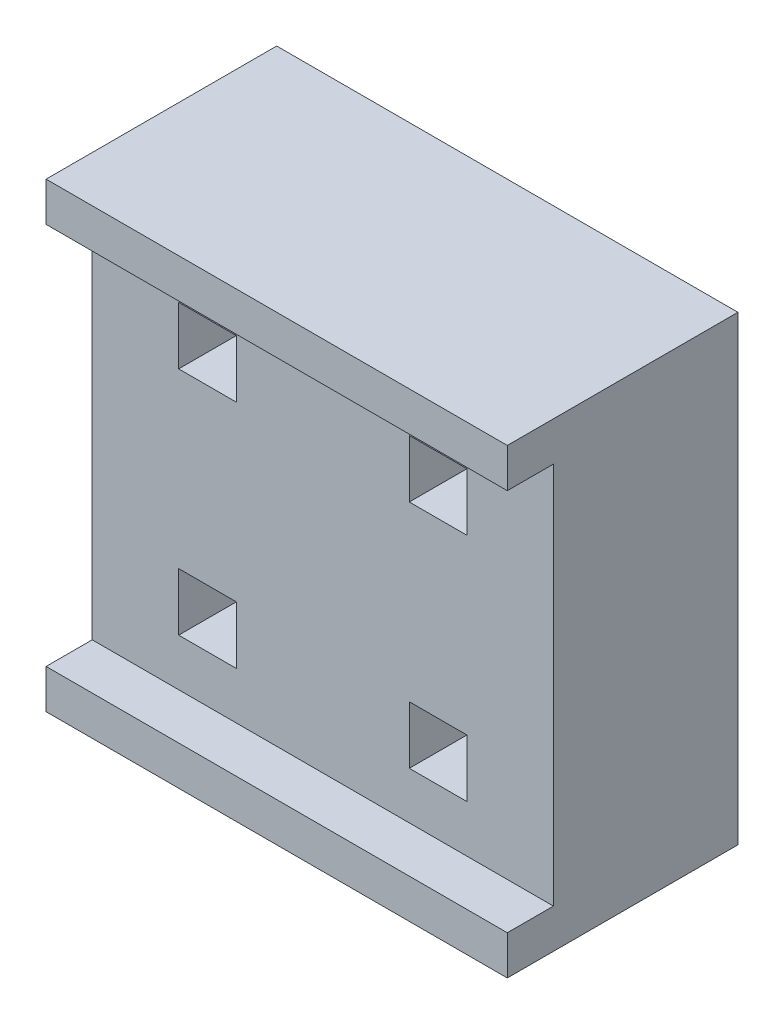
ISO-10303-21;
HEADER;
FILE_DESCRIPTION(('STEP AP214'),'2;1');
FILE_NAME('part.step','',(''),(''),'','','');
FILE_SCHEMA(('AUTOMOTIVE_DESIGN { 1 0 10303 214 1 1 1 1 }'));
ENDSEC;
DATA;
#1=APPLICATION_CONTEXT('core data for automotive mechanical design processes');
#2=APPLICATION_PROTOCOL_DEFINITION('international standard','automotive_design',2000,#1);
#3=PRODUCT_CONTEXT('',#1,'mechanical');
#4=PRODUCT('Part','Part','',(#3));
#5=PRODUCT_RELATED_PRODUCT_CATEGORY('part','',(#4));
#6=PRODUCT_DEFINITION_FORMATION('','',#4);
#7=PRODUCT_DEFINITION_CONTEXT('part definition',#1,'design');
#8=PRODUCT_DEFINITION('design','',#6,#7);
#9=PRODUCT_DEFINITION_SHAPE('','',#8);
#10=(LENGTH_UNIT() NAMED_UNIT(*) SI_UNIT(.MILLI.,.METRE.));
#11=(NAMED_UNIT(*) PLANE_ANGLE_UNIT() SI_UNIT($,.RADIAN.));
#12=(NAMED_UNIT(*) SI_UNIT($,.STERADIAN.) SOLID_ANGLE_UNIT());
#13=UNCERTAINTY_MEASURE_WITH_UNIT(LENGTH_MEASURE(1.E-05),#10,'distance_accuracy_value','');
#14=(GEOMETRIC_REPRESENTATION_CONTEXT(3) GLOBAL_UNCERTAINTY_ASSIGNED_CONTEXT((#13)) GLOBAL_UNIT_ASSIGNED_CONTEXT((#10,
#11,#12)) REPRESENTATION_CONTEXT('',''));
#15=CARTESIAN_POINT('',(0.,0.,0.));
#16=DIRECTION('',(0.,0.,1.));
#17=DIRECTION('',(1.,0.,0.));
#18=AXIS2_PLACEMENT_3D('',#15,#16,#17);
#19=CARTESIAN_POINT('',(0.000117822266474832,0.000123801387605624,6.33));
#20=DIRECTION('',(0.,-4.37113882867379E-08,1.));
#21=DIRECTION('',(0.,-1.,-4.37113882867379E-08));
#22=AXIS2_PLACEMENT_3D('',#19,#20,#21);
#23=PLANE('',#22);
#24=DIRECTION('',(1.,0.,0.));
#25=VECTOR('',#24,1.);
#26=CARTESIAN_POINT('',(-2.53988217773353,-2.10807619861239,6.32999990784765));
#27=LINE('',#26,#25);
#28=CARTESIAN_POINT('',(-2.53988217773353,-2.10807619861239,6.32999990784765));
#29=VERTEX_POINT('',#28);
#30=CARTESIAN_POINT('',(2.54011782226648,-2.10807619861239,6.32999990784765));
#31=VERTEX_POINT('',#30);
#32=EDGE_CURVE('E11',#29,#31,#27,.T.);
#33=ORIENTED_EDGE('',*,*,#32,.F.);
#34=DIRECTION('',(0.,-0.999999999999999,-4.37113882735736E-08));
#35=VECTOR('',#34,1.);
#36=CARTESIAN_POINT('',(-2.53988217773352,-2.1080761986124,6.32999990784765));
#37=LINE('',#36,#35);
#38=CARTESIAN_POINT('',(-2.53988217773353,-2.53987619861239,6.32999988897307));
#39=VERTEX_POINT('',#38);
#40=EDGE_CURVE('E368',#29,#39,#37,.T.);
#41=ORIENTED_EDGE('',*,*,#40,.T.);
#42=DIRECTION('',(1.,0.,0.));
#43=VECTOR('',#42,1.);
#44=CARTESIAN_POINT('',(-2.53988217773353,-2.53987619861239,6.32999988897307));
#45=LINE('',#44,#43);
#46=CARTESIAN_POINT('',(2.54011782226648,-2.53987619861239,6.32999988897307));
#47=VERTEX_POINT('',#46);
#48=EDGE_CURVE('E366',#39,#47,#45,.T.);
#49=ORIENTED_EDGE('',*,*,#48,.T.);
#50=DIRECTION('',(0.,0.999999999999999,4.37113882735736E-08));
#51=VECTOR('',#50,1.);
#52=CARTESIAN_POINT('',(2.54011782226648,-2.53987619861239,6.32999988897307));
#53=LINE('',#52,#51);
#54=EDGE_CURVE('E354',#47,#31,#53,.T.);
#55=ORIENTED_EDGE('',*,*,#54,.T.);
#56=EDGE_LOOP('',(#33,#41,#49,#55));
#57=FACE_BOUND('',#56,.T.);
#58=ADVANCED_FACE('F17',(#57),#23,.T.);
#59=CARTESIAN_POINT('',(-2.53988217773353,2.54012391241453,3.79000011102693));
#60=DIRECTION('',(-1.,0.,0.));
#61=DIRECTION('',(0.,-1.,-4.37113882867379E-08));
#62=AXIS2_PLACEMENT_3D('',#59,#60,#61);
#63=PLANE('',#62);
#64=DIRECTION('',(0.,4.37113897134182E-08,-0.999999999999999));
#65=VECTOR('',#64,1.);
#66=CARTESIAN_POINT('',(-2.53988217773353,-2.10807619861239,6.32999990784765));
#67=LINE('',#66,#65);
#68=CARTESIAN_POINT('',(-2.53988217773353,-2.10807617640701,5.82199990784765));
#69=VERTEX_POINT('',#68);
#70=EDGE_CURVE('E24',#29,#69,#67,.T.);
#71=ORIENTED_EDGE('',*,*,#70,.T.);
#72=DIRECTION('',(0.,0.999999999999999,4.37113881124894E-08));
#73=VECTOR('',#72,1.);
#74=CARTESIAN_POINT('',(-2.53988217773353,-2.10807617640701,5.82199990784765));
#75=LINE('',#74,#73);
#76=CARTESIAN_POINT('',(-2.53988217773353,2.10832382359299,5.82200009215235));
#77=VERTEX_POINT('',#76);
#78=EDGE_CURVE('E364',#69,#77,#75,.T.);
#79=ORIENTED_EDGE('',*,*,#78,.T.);
#80=DIRECTION('',(0.,-4.37113888392268E-08,0.999999999999999));
#81=VECTOR('',#80,1.);
#82=CARTESIAN_POINT('',(-2.53988217773353,2.10832382359299,5.82200009215235));
#83=LINE('',#82,#81);
#84=CARTESIAN_POINT('',(-2.53988217773353,2.10832380138761,6.33000009215235));
#85=VERTEX_POINT('',#84);
#86=EDGE_CURVE('E356',#77,#85,#83,.T.);
#87=ORIENTED_EDGE('',*,*,#86,.T.);
#88=DIRECTION('',(0.,-0.999999999999999,-4.37113882735736E-08));
#89=VECTOR('',#88,1.);
#90=CARTESIAN_POINT('',(-2.53988217773353,2.54012380138761,6.33000011102693));
#91=LINE('',#90,#89);
#92=CARTESIAN_POINT('',(-2.53988217773353,2.54012380138761,6.33000011102693));
#93=VERTEX_POINT('',#92);
#94=EDGE_CURVE('E347',#93,#85,#91,.T.);
#95=ORIENTED_EDGE('',*,*,#94,.F.);
#96=DIRECTION('',(0.,-4.3711388314712E-08,0.999999999999999));
#97=VECTOR('',#96,1.);
#98=CARTESIAN_POINT('',(-2.53988217773353,2.54012391241453,3.79000011102693));
#99=LINE('',#98,#97);
#100=CARTESIAN_POINT('',(-2.53988217773353,2.54012391241453,3.79000011102693));
#101=VERTEX_POINT('',#100);
#102=EDGE_CURVE('E337',#101,#93,#99,.T.);
#103=ORIENTED_EDGE('',*,*,#102,.F.);
#104=DIRECTION('',(0.,-0.999999999999999,-4.37113884895503E-08));
#105=VECTOR('',#104,1.);
#106=CARTESIAN_POINT('',(-2.53988217773353,2.54012391241453,3.79000011102693));
#107=LINE('',#106,#105);
#108=CARTESIAN_POINT('',(-2.53988217773353,-2.53987608758547,3.78999988897307));
#109=VERTEX_POINT('',#108);
#110=EDGE_CURVE('E324',#101,#109,#107,.T.);
#111=ORIENTED_EDGE('',*,*,#110,.T.);
#112=DIRECTION('',(0.,-4.3711388314712E-08,0.999999999999999));
#113=VECTOR('',#112,1.);
#114=CARTESIAN_POINT('',(-2.53988217773353,-2.53987608758547,3.78999988897307));
#115=LINE('',#114,#113);
#116=EDGE_CURVE('E358',#109,#39,#115,.T.);
#117=ORIENTED_EDGE('',*,*,#116,.T.);
#118=ORIENTED_EDGE('',*,*,#40,.F.);
#119=EDGE_LOOP('',(#71,#79,#87,#95,#103,#111,#117,#118));
#120=FACE_BOUND('',#119,.T.);
#121=ADVANCED_FACE('F374',(#120),#63,.T.);
#122=CARTESIAN_POINT('',(-2.53988217773353,-2.53987608758547,3.78999988897307));
#123=DIRECTION('',(0.,-1.,-4.37113882867379E-08));
#124=DIRECTION('',(1.,0.,0.));
#125=AXIS2_PLACEMENT_3D('',#122,#123,#124);
#126=PLANE('',#125);
#127=ORIENTED_EDGE('',*,*,#48,.F.);
#128=ORIENTED_EDGE('',*,*,#116,.F.);
#129=DIRECTION('',(1.,0.,0.));
#130=VECTOR('',#129,1.);
#131=CARTESIAN_POINT('',(-2.53988217773353,-2.53987608758547,3.78999988897307));
#132=LINE('',#131,#130);
#133=CARTESIAN_POINT('',(2.54011782226648,-2.53987608758547,3.78999988897307));
#134=VERTEX_POINT('',#133);
#135=EDGE_CURVE('E350',#109,#134,#132,.T.);
#136=ORIENTED_EDGE('',*,*,#135,.T.);
#137=DIRECTION('',(0.,-4.3711388314712E-08,0.999999999999999));
#138=VECTOR('',#137,1.);
#139=CARTESIAN_POINT('',(2.54011782226648,-2.53987608758547,3.78999988897307));
#140=LINE('',#139,#138);
#141=EDGE_CURVE('E340',#134,#47,#140,.T.);
#142=ORIENTED_EDGE('',*,*,#141,.T.);
#143=EDGE_LOOP('',(#127,#128,#136,#142));
#144=FACE_BOUND('',#143,.T.);
#145=ADVANCED_FACE('F372',(#144),#126,.T.);
#146=CARTESIAN_POINT('',(2.54011782226648,-2.53987608758547,3.78999988897307));
#147=DIRECTION('',(1.,0.,0.));
#148=DIRECTION('',(0.,1.,4.37113882867379E-08));
#149=AXIS2_PLACEMENT_3D('',#146,#147,#148);
#150=PLANE('',#149);
#151=DIRECTION('',(0.,4.37113897134182E-08,-0.999999999999999));
#152=VECTOR('',#151,1.);
#153=CARTESIAN_POINT('',(2.54011782226648,-2.10807619861239,6.32999990784765));
#154=LINE('',#153,#152);
#155=CARTESIAN_POINT('',(2.54011782226648,-2.10807617640701,5.82199990784765));
#156=VERTEX_POINT('',#155);
#157=EDGE_CURVE('E361',#31,#156,#154,.T.);
#158=ORIENTED_EDGE('',*,*,#157,.F.);
#159=ORIENTED_EDGE('',*,*,#54,.F.);
#160=ORIENTED_EDGE('',*,*,#141,.F.);
#161=DIRECTION('',(0.,0.999999999999999,4.37113881398737E-08));
#162=VECTOR('',#161,1.);
#163=CARTESIAN_POINT('',(2.54011782226648,-2.53987608758547,3.78999988897307));
#164=LINE('',#163,#162);
#165=CARTESIAN_POINT('',(2.54011782226648,2.54012391241453,3.79000011102693));
#166=VERTEX_POINT('',#165);
#167=EDGE_CURVE('E327',#134,#166,#164,.T.);
#168=ORIENTED_EDGE('',*,*,#167,.T.);
#169=DIRECTION('',(0.,-4.3711388314712E-08,0.999999999999999));
#170=VECTOR('',#169,1.);
#171=CARTESIAN_POINT('',(2.54011782226648,2.54012391241453,3.79000011102693));
#172=LINE('',#171,#170);
#173=CARTESIAN_POINT('',(2.54011782226648,2.54012380138761,6.33000011102693));
#174=VERTEX_POINT('',#173);
#175=EDGE_CURVE('E314',#166,#174,#172,.T.);
#176=ORIENTED_EDGE('',*,*,#175,.T.);
#177=DIRECTION('',(0.,0.999999999999999,4.37113882735736E-08));
#178=VECTOR('',#177,1.);
#179=CARTESIAN_POINT('',(2.54011782226647,2.10832380138761,6.33000009215235));
#180=LINE('',#179,#178);
#181=CARTESIAN_POINT('',(2.54011782226648,2.10832380138761,6.33000009215235));
#182=VERTEX_POINT('',#181);
#183=EDGE_CURVE('E304',#182,#174,#180,.T.);
#184=ORIENTED_EDGE('',*,*,#183,.F.);
#185=DIRECTION('',(0.,-4.37113888392268E-08,0.999999999999999));
#186=VECTOR('',#185,1.);
#187=CARTESIAN_POINT('',(2.54011782226648,2.10832382359299,5.82200009215235));
#188=LINE('',#187,#186);
#189=CARTESIAN_POINT('',(2.54011782226648,2.10832382359299,5.82200009215235));
#190=VERTEX_POINT('',#189);
#191=EDGE_CURVE('E290',#190,#182,#188,.T.);
#192=ORIENTED_EDGE('',*,*,#191,.F.);
#193=DIRECTION('',(0.,0.999999999999999,4.37113881124894E-08));
#194=VECTOR('',#193,1.);
#195=CARTESIAN_POINT('',(2.54011782226648,-2.10807617640701,5.82199990784765));
#196=LINE('',#195,#194);
#197=EDGE_CURVE('E279',#156,#190,#196,.T.);
#198=ORIENTED_EDGE('',*,*,#197,.F.);
#199=EDGE_LOOP('',(#158,#159,#160,#168,#176,#184,#192,#198));
#200=FACE_BOUND('',#199,.T.);
#201=ADVANCED_FACE('F382',(#200),#150,.T.);
#202=CARTESIAN_POINT('',(0.952617822266475,1.58762391241453,3.79000006939183));
#203=DIRECTION('',(-1.,0.,0.));
#204=DIRECTION('',(0.,-1.,-4.37113882867379E-08));
#205=AXIS2_PLACEMENT_3D('',#202,#203,#204);
#206=PLANE('',#205);
#207=DIRECTION('',(0.,-4.37113881835833E-08,0.999999999999999));
#208=VECTOR('',#207,1.);
#209=CARTESIAN_POINT('',(0.952617822266475,1.58762391241453,3.79000006939183));
#210=LINE('',#209,#208);
#211=CARTESIAN_POINT('',(0.952617822266475,1.58762391241453,3.79000006939183));
#212=VERTEX_POINT('',#211);
#213=CARTESIAN_POINT('',(0.952617822266475,1.58762382359299,5.82200006939183));
#214=VERTEX_POINT('',#213);
#215=EDGE_CURVE('E352',#212,#214,#210,.T.);
#216=ORIENTED_EDGE('',*,*,#215,.T.);
#217=DIRECTION('',(0.,-0.999999999999999,-4.37113890140651E-08));
#218=VECTOR('',#217,1.);
#219=CARTESIAN_POINT('',(0.952617822266475,1.58762382359299,5.82200006939183));
#220=LINE('',#219,#218);
#221=CARTESIAN_POINT('',(0.952617822266475,0.952623823592991,5.8220000416351));
#222=VERTEX_POINT('',#221);
#223=EDGE_CURVE('E343',#214,#222,#220,.T.);
#224=ORIENTED_EDGE('',*,*,#223,.T.);
#225=DIRECTION('',(0.,-4.37113882928572E-08,0.999999999999999));
#226=VECTOR('',#225,1.);
#227=CARTESIAN_POINT('',(0.952617822266475,0.952623912414532,3.7900000416351));
#228=LINE('',#227,#226);
#229=CARTESIAN_POINT('',(0.952617822266475,0.952623912414532,3.7900000416351));
#230=VERTEX_POINT('',#229);
#231=EDGE_CURVE('E329',#230,#222,#228,.T.);
#232=ORIENTED_EDGE('',*,*,#231,.F.);
#233=DIRECTION('',(0.,-0.999999999999999,-4.3711388314712E-08));
#234=VECTOR('',#233,1.);
#235=CARTESIAN_POINT('',(0.952617822266475,1.58762391241453,3.79000006939183));
#236=LINE('',#235,#234);
#237=EDGE_CURVE('E316',#212,#230,#236,.T.);
#238=ORIENTED_EDGE('',*,*,#237,.F.);
#239=EDGE_LOOP('',(#216,#224,#232,#238));
#240=FACE_BOUND('',#239,.T.);
#241=ADVANCED_FACE('F426',(#240),#206,.F.);
#242=CARTESIAN_POINT('',(1.58761782226647,1.58762391241453,3.79000006939183));
#243=DIRECTION('',(0.,1.,4.37113882867379E-08));
#244=DIRECTION('',(-1.,0.,0.));
#245=AXIS2_PLACEMENT_3D('',#242,#243,#244);
#246=PLANE('',#245);
#247=DIRECTION('',(0.,-4.37113881835833E-08,0.999999999999999));
#248=VECTOR('',#247,1.);
#249=CARTESIAN_POINT('',(1.58761782226647,1.58762391241453,3.79000006939183));
#250=LINE('',#249,#248);
#251=CARTESIAN_POINT('',(1.58761782226647,1.58762391241453,3.79000006939183));
#252=VERTEX_POINT('',#251);
#253=CARTESIAN_POINT('',(1.58761782226647,1.58762382359299,5.82200006939183));
#254=VERTEX_POINT('',#253);
#255=EDGE_CURVE('E345',#252,#254,#250,.T.);
#256=ORIENTED_EDGE('',*,*,#255,.T.);
#257=DIRECTION('',(-1.,0.,0.));
#258=VECTOR('',#257,1.);
#259=CARTESIAN_POINT('',(1.58761782226647,1.58762382359299,5.82200006939183));
#260=LINE('',#259,#258);
#261=EDGE_CURVE('E332',#254,#214,#260,.T.);
#262=ORIENTED_EDGE('',*,*,#261,.T.);
#263=ORIENTED_EDGE('',*,*,#215,.F.);
#264=DIRECTION('',(-1.,0.,0.));
#265=VECTOR('',#264,1.);
#266=CARTESIAN_POINT('',(1.58761782226647,1.58762391241453,3.79000006939183));
#267=LINE('',#266,#265);
#268=EDGE_CURVE('E307',#252,#212,#267,.T.);
#269=ORIENTED_EDGE('',*,*,#268,.F.);
#270=EDGE_LOOP('',(#256,#262,#263,#269));
#271=FACE_BOUND('',#270,.T.);
#272=ADVANCED_FACE('F431',(#271),#246,.F.);
#273=CARTESIAN_POINT('',(1.58761782226647,0.952623912414532,3.7900000416351));
#274=DIRECTION('',(1.,0.,0.));
#275=DIRECTION('',(0.,1.,4.37113882867379E-08));
#276=AXIS2_PLACEMENT_3D('',#273,#274,#275);
#277=PLANE('',#276);
#278=DIRECTION('',(0.,-4.37113882928572E-08,0.999999999999999));
#279=VECTOR('',#278,1.);
#280=CARTESIAN_POINT('',(1.58761782226647,0.952623912414532,3.7900000416351));
#281=LINE('',#280,#279);
#282=CARTESIAN_POINT('',(1.58761782226647,0.952623912414532,3.7900000416351));
#283=VERTEX_POINT('',#282);
#284=CARTESIAN_POINT('',(1.58761782226647,0.952623823592991,5.8220000416351));
#285=VERTEX_POINT('',#284);
#286=EDGE_CURVE('E335',#283,#285,#281,.T.);
#287=ORIENTED_EDGE('',*,*,#286,.T.);
#288=DIRECTION('',(0.,0.999999999999999,4.37113890140651E-08));
#289=VECTOR('',#288,1.);
#290=CARTESIAN_POINT('',(1.58761782226647,0.952623823592991,5.8220000416351));
#291=LINE('',#290,#289);
#292=EDGE_CURVE('E319',#285,#254,#291,.T.);
#293=ORIENTED_EDGE('',*,*,#292,.T.);
#294=ORIENTED_EDGE('',*,*,#255,.F.);
#295=DIRECTION('',(0.,0.999999999999999,4.3711388314712E-08));
#296=VECTOR('',#295,1.);
#297=CARTESIAN_POINT('',(1.58761782226647,0.952623912414532,3.7900000416351));
#298=LINE('',#297,#296);
#299=EDGE_CURVE('E293',#283,#252,#298,.T.);
#300=ORIENTED_EDGE('',*,*,#299,.F.);
#301=EDGE_LOOP('',(#287,#293,#294,#300));
#302=FACE_BOUND('',#301,.T.);
#303=ADVANCED_FACE('F436',(#302),#277,.F.);
#304=CARTESIAN_POINT('',(0.952617822266475,-0.952376087585468,3.7899999583649));
#305=DIRECTION('',(-1.,0.,0.));
#306=DIRECTION('',(0.,-1.,-4.37113882867379E-08));
#307=AXIS2_PLACEMENT_3D('',#304,#305,#306);
#308=PLANE('',#307);
#309=DIRECTION('',(0.,-4.37113882928572E-08,0.999999999999999));
#310=VECTOR('',#309,1.);
#311=CARTESIAN_POINT('',(0.952617822266475,-0.952376087585468,3.7899999583649));
#312=LINE('',#311,#310);
#313=CARTESIAN_POINT('',(0.952617822266475,-0.952376087585468,3.7899999583649));
#314=VERTEX_POINT('',#313);
#315=CARTESIAN_POINT('',(0.952617822266475,-0.952376176407009,5.8219999583649));
#316=VERTEX_POINT('',#315);
#317=EDGE_CURVE('E322',#314,#316,#312,.T.);
#318=ORIENTED_EDGE('',*,*,#317,.T.);
#319=DIRECTION('',(0.,-0.999999999999999,-4.37113890140651E-08));
#320=VECTOR('',#319,1.);
#321=CARTESIAN_POINT('',(0.952617822266475,-0.952376176407009,5.8219999583649));
#322=LINE('',#321,#320);
#323=CARTESIAN_POINT('',(0.952617822266475,-1.58737617640701,5.82199993060817));
#324=VERTEX_POINT('',#323);
#325=EDGE_CURVE('E310',#316,#324,#322,.T.);
#326=ORIENTED_EDGE('',*,*,#325,.T.);
#327=DIRECTION('',(0.,-4.37113884021311E-08,0.999999999999999));
#328=VECTOR('',#327,1.);
#329=CARTESIAN_POINT('',(0.952617822266475,-1.58737608758547,3.78999993060817));
#330=LINE('',#329,#328);
#331=CARTESIAN_POINT('',(0.952617822266475,-1.58737608758547,3.78999993060817));
#332=VERTEX_POINT('',#331);
#333=EDGE_CURVE('E296',#332,#324,#330,.T.);
#334=ORIENTED_EDGE('',*,*,#333,.F.);
#335=DIRECTION('',(0.,-0.999999999999999,-4.3711388314712E-08));
#336=VECTOR('',#335,1.);
#337=CARTESIAN_POINT('',(0.952617822266475,-0.952376087585468,3.7899999583649));
#338=LINE('',#337,#336);
#339=EDGE_CURVE('E282',#314,#332,#338,.T.);
#340=ORIENTED_EDGE('',*,*,#339,.F.);
#341=EDGE_LOOP('',(#318,#326,#334,#340));
#342=FACE_BOUND('',#341,.T.);
#343=ADVANCED_FACE('F441',(#342),#308,.F.);
#344=CARTESIAN_POINT('',(1.58761782226647,-0.952376087585468,3.7899999583649));
#345=DIRECTION('',(0.,1.,4.37113882867379E-08));
#346=DIRECTION('',(-1.,0.,0.));
#347=AXIS2_PLACEMENT_3D('',#344,#345,#346);
#348=PLANE('',#347);
#349=DIRECTION('',(0.,-4.37113882928572E-08,0.999999999999999));
#350=VECTOR('',#349,1.);
#351=CARTESIAN_POINT('',(1.58761782226647,-0.952376087585468,3.7899999583649));
#352=LINE('',#351,#350);
#353=CARTESIAN_POINT('',(1.58761782226647,-0.952376087585468,3.7899999583649));
#354=VERTEX_POINT('',#353);
#355=CARTESIAN_POINT('',(1.58761782226647,-0.952376176407009,5.8219999583649));
#356=VERTEX_POINT('',#355);
#357=EDGE_CURVE('E312',#354,#356,#352,.T.);
#358=ORIENTED_EDGE('',*,*,#357,.T.);
#359=DIRECTION('',(-1.,0.,0.));
#360=VECTOR('',#359,1.);
#361=CARTESIAN_POINT('',(1.58761782226647,-0.952376176407009,5.8219999583649));
#362=LINE('',#361,#360);
#363=EDGE_CURVE('E299',#356,#316,#362,.T.);
#364=ORIENTED_EDGE('',*,*,#363,.T.);
#365=ORIENTED_EDGE('',*,*,#317,.F.);
#366=DIRECTION('',(-1.,0.,0.));
#367=VECTOR('',#366,1.);
#368=CARTESIAN_POINT('',(1.58761782226647,-0.952376087585468,3.7899999583649));
#369=LINE('',#368,#367);
#370=EDGE_CURVE('E272',#354,#314,#369,.T.);
#371=ORIENTED_EDGE('',*,*,#370,.F.);
#372=EDGE_LOOP('',(#358,#364,#365,#371));
#373=FACE_BOUND('',#372,.T.);
#374=ADVANCED_FACE('F446',(#373),#348,.F.);
#375=CARTESIAN_POINT('',(1.58761782226647,-1.58737608758547,3.78999993060817));
#376=DIRECTION('',(1.,0.,0.));
#377=DIRECTION('',(0.,1.,4.37113882867379E-08));
#378=AXIS2_PLACEMENT_3D('',#375,#376,#377);
#379=PLANE('',#378);
#380=DIRECTION('',(0.,-4.37113884021311E-08,0.999999999999999));
#381=VECTOR('',#380,1.);
#382=CARTESIAN_POINT('',(1.58761782226647,-1.58737608758547,3.78999993060817));
#383=LINE('',#382,#381);
#384=CARTESIAN_POINT('',(1.58761782226647,-1.58737608758547,3.78999993060817));
#385=VERTEX_POINT('',#384);
#386=CARTESIAN_POINT('',(1.58761782226647,-1.58737617640701,5.82199993060817));
#387=VERTEX_POINT('',#386);
#388=EDGE_CURVE('E302',#385,#387,#383,.T.);
#389=ORIENTED_EDGE('',*,*,#388,.T.);
#390=DIRECTION('',(0.,0.999999999999999,4.37113890140651E-08));
#391=VECTOR('',#390,1.);
#392=CARTESIAN_POINT('',(1.58761782226647,-1.58737617640701,5.82199993060817));
#393=LINE('',#392,#391);
#394=EDGE_CURVE('E285',#387,#356,#393,.T.);
#395=ORIENTED_EDGE('',*,*,#394,.T.);
#396=ORIENTED_EDGE('',*,*,#357,.F.);
#397=DIRECTION('',(0.,0.999999999999999,4.3711388314712E-08));
#398=VECTOR('',#397,1.);
#399=CARTESIAN_POINT('',(1.58761782226647,-1.58737608758547,3.78999993060817));
#400=LINE('',#399,#398);
#401=EDGE_CURVE('E261',#385,#354,#400,.T.);
#402=ORIENTED_EDGE('',*,*,#401,.F.);
#403=EDGE_LOOP('',(#389,#395,#396,#402));
#404=FACE_BOUND('',#403,.T.);
#405=ADVANCED_FACE('F474',(#404),#379,.F.);
#406=CARTESIAN_POINT('',(-1.58738217773353,1.58762391241453,3.79000006939183));
#407=DIRECTION('',(-1.,0.,0.));
#408=DIRECTION('',(0.,-1.,-4.37113882867379E-08));
#409=AXIS2_PLACEMENT_3D('',#406,#407,#408);
#410=PLANE('',#409);
#411=DIRECTION('',(0.,-4.37113881835833E-08,0.999999999999999));
#412=VECTOR('',#411,1.);
#413=CARTESIAN_POINT('',(-1.58738217773353,1.58762391241453,3.79000006939183));
#414=LINE('',#413,#412);
#415=CARTESIAN_POINT('',(-1.58738217773353,1.58762391241453,3.79000006939183));
#416=VERTEX_POINT('',#415);
#417=CARTESIAN_POINT('',(-1.58738217773353,1.58762382359299,5.82200006939183));
#418=VERTEX_POINT('',#417);
#419=EDGE_CURVE('E288',#416,#418,#414,.T.);
#420=ORIENTED_EDGE('',*,*,#419,.T.);
#421=DIRECTION('',(0.,-0.999999999999999,-4.37113890140651E-08));
#422=VECTOR('',#421,1.);
#423=CARTESIAN_POINT('',(-1.58738217773353,1.58762382359299,5.82200006939183));
#424=LINE('',#423,#422);
#425=CARTESIAN_POINT('',(-1.58738217773353,0.952623823592991,5.8220000416351));
#426=VERTEX_POINT('',#425);
#427=EDGE_CURVE('E275',#418,#426,#424,.T.);
#428=ORIENTED_EDGE('',*,*,#427,.T.);
#429=DIRECTION('',(0.,-4.37113882928572E-08,0.999999999999999));
#430=VECTOR('',#429,1.);
#431=CARTESIAN_POINT('',(-1.58738217773353,0.952623912414532,3.7900000416351));
#432=LINE('',#431,#430);
#433=CARTESIAN_POINT('',(-1.58738217773353,0.952623912414532,3.7900000416351));
#434=VERTEX_POINT('',#433);
#435=EDGE_CURVE('E264',#434,#426,#432,.T.);
#436=ORIENTED_EDGE('',*,*,#435,.F.);
#437=DIRECTION('',(0.,-0.999999999999999,-4.3711388314712E-08));
#438=VECTOR('',#437,1.);
#439=CARTESIAN_POINT('',(-1.58738217773353,1.58762391241453,3.79000006939183));
#440=LINE('',#439,#438);
#441=EDGE_CURVE('E253',#416,#434,#440,.T.);
#442=ORIENTED_EDGE('',*,*,#441,.F.);
#443=EDGE_LOOP('',(#420,#428,#436,#442));
#444=FACE_BOUND('',#443,.T.);
#445=ADVANCED_FACE('F478',(#444),#410,.F.);
#446=CARTESIAN_POINT('',(-0.952382177733525,1.58762391241453,3.79000006939183));
#447=DIRECTION('',(0.,1.,4.37113882867379E-08));
#448=DIRECTION('',(-1.,0.,0.));
#449=AXIS2_PLACEMENT_3D('',#446,#447,#448);
#450=PLANE('',#449);
#451=DIRECTION('',(0.,-4.37113881835833E-08,0.999999999999999));
#452=VECTOR('',#451,1.);
#453=CARTESIAN_POINT('',(-0.952382177733525,1.58762391241453,3.79000006939183));
#454=LINE('',#453,#452);
#455=CARTESIAN_POINT('',(-0.952382177733525,1.58762391241453,3.79000006939183));
#456=VERTEX_POINT('',#455);
#457=CARTESIAN_POINT('',(-0.952382177733525,1.58762382359299,5.82200006939183));
#458=VERTEX_POINT('',#457);
#459=EDGE_CURVE('E277',#456,#458,#454,.T.);
#460=ORIENTED_EDGE('',*,*,#459,.T.);
#461=DIRECTION('',(-1.,0.,0.));
#462=VECTOR('',#461,1.);
#463=CARTESIAN_POINT('',(-0.952382177733525,1.58762382359299,5.82200006939183));
#464=LINE('',#463,#462);
#465=EDGE_CURVE('E267',#458,#418,#464,.T.);
#466=ORIENTED_EDGE('',*,*,#465,.T.);
#467=ORIENTED_EDGE('',*,*,#419,.F.);
#468=DIRECTION('',(-1.,0.,0.));
#469=VECTOR('',#468,1.);
#470=CARTESIAN_POINT('',(-0.952382177733525,1.58762391241453,3.79000006939183));
#471=LINE('',#470,#469);
#472=EDGE_CURVE('E197',#456,#416,#471,.T.);
#473=ORIENTED_EDGE('',*,*,#472,.F.);
#474=EDGE_LOOP('',(#460,#466,#467,#473));
#475=FACE_BOUND('',#474,.T.);
#476=ADVANCED_FACE('F481',(#475),#450,.F.);
#477=CARTESIAN_POINT('',(-0.952382177733525,0.952623912414532,3.7900000416351));
#478=DIRECTION('',(1.,0.,0.));
#479=DIRECTION('',(0.,1.,4.37113882867379E-08));
#480=AXIS2_PLACEMENT_3D('',#477,#478,#479);
#481=PLANE('',#480);
#482=DIRECTION('',(0.,-4.37113882928572E-08,0.999999999999999));
#483=VECTOR('',#482,1.);
#484=CARTESIAN_POINT('',(-0.952382177733525,0.952623912414532,3.7900000416351));
#485=LINE('',#484,#483);
#486=CARTESIAN_POINT('',(-0.952382177733525,0.952623912414532,3.7900000416351));
#487=VERTEX_POINT('',#486);
#488=CARTESIAN_POINT('',(-0.952382177733525,0.952623823592991,5.8220000416351));
#489=VERTEX_POINT('',#488);
#490=EDGE_CURVE('E270',#487,#489,#485,.T.);
#491=ORIENTED_EDGE('',*,*,#490,.T.);
#492=DIRECTION('',(0.,0.999999999999999,4.37113890140651E-08));
#493=VECTOR('',#492,1.);
#494=CARTESIAN_POINT('',(-0.952382177733525,0.952623823592991,5.8220000416351));
#495=LINE('',#494,#493);
#496=EDGE_CURVE('E256',#489,#458,#495,.T.);
#497=ORIENTED_EDGE('',*,*,#496,.T.);
#498=ORIENTED_EDGE('',*,*,#459,.F.);
#499=DIRECTION('',(0.,0.999999999999999,4.3711388314712E-08));
#500=VECTOR('',#499,1.);
#501=CARTESIAN_POINT('',(-0.952382177733525,0.952623912414532,3.7900000416351));
#502=LINE('',#501,#500);
#503=EDGE_CURVE('E241',#487,#456,#502,.T.);
#504=ORIENTED_EDGE('',*,*,#503,.F.);
#505=EDGE_LOOP('',(#491,#497,#498,#504));
#506=FACE_BOUND('',#505,.T.);
#507=ADVANCED_FACE('F486',(#506),#481,.F.);
#508=CARTESIAN_POINT('',(-1.58738217773353,-0.952376087585468,3.7899999583649));
#509=DIRECTION('',(-1.,0.,0.));
#510=DIRECTION('',(0.,-1.,-4.37113882867379E-08));
#511=AXIS2_PLACEMENT_3D('',#508,#509,#510);
#512=PLANE('',#511);
#513=DIRECTION('',(0.,-4.37113882928572E-08,0.999999999999999));
#514=VECTOR('',#513,1.);
#515=CARTESIAN_POINT('',(-1.58738217773353,-0.952376087585468,3.7899999583649));
#516=LINE('',#515,#514);
#517=CARTESIAN_POINT('',(-1.58738217773353,-0.952376087585468,3.7899999583649));
#518=VERTEX_POINT('',#517);
#519=CARTESIAN_POINT('',(-1.58738217773353,-0.952376176407009,5.8219999583649));
#520=VERTEX_POINT('',#519);
#521=EDGE_CURVE('E259',#518,#520,#516,.T.);
#522=ORIENTED_EDGE('',*,*,#521,.T.);
#523=DIRECTION('',(0.,-0.999999999999999,-4.37113890140651E-08));
#524=VECTOR('',#523,1.);
#525=CARTESIAN_POINT('',(-1.58738217773353,-0.952376176407009,5.8219999583649));
#526=LINE('',#525,#524);
#527=CARTESIAN_POINT('',(-1.58738217773353,-1.58737617640701,5.82199993060817));
#528=VERTEX_POINT('',#527);
#529=EDGE_CURVE('E250',#520,#528,#526,.T.);
#530=ORIENTED_EDGE('',*,*,#529,.T.);
#531=DIRECTION('',(0.,-4.37113884021311E-08,0.999999999999999));
#532=VECTOR('',#531,1.);
#533=CARTESIAN_POINT('',(-1.58738217773353,-1.58737608758547,3.78999993060817));
#534=LINE('',#533,#532);
#535=CARTESIAN_POINT('',(-1.58738217773353,-1.58737608758547,3.78999993060817));
#536=VERTEX_POINT('',#535);
#537=EDGE_CURVE('E244',#536,#528,#534,.T.);
#538=ORIENTED_EDGE('',*,*,#537,.F.);
#539=DIRECTION('',(0.,-0.999999999999999,-4.3711388314712E-08));
#540=VECTOR('',#539,1.);
#541=CARTESIAN_POINT('',(-1.58738217773353,-0.952376087585468,3.7899999583649));
#542=LINE('',#541,#540);
#543=EDGE_CURVE('E202',#518,#536,#542,.T.);
#544=ORIENTED_EDGE('',*,*,#543,.F.);
#545=EDGE_LOOP('',(#522,#530,#538,#544));
#546=FACE_BOUND('',#545,.T.);
#547=ADVANCED_FACE('F490',(#546),#512,.F.);
#548=CARTESIAN_POINT('',(-0.952382177733525,-0.952376087585468,3.7899999583649));
#549=DIRECTION('',(0.,1.,4.37113882867379E-08));
#550=DIRECTION('',(-1.,0.,0.));
#551=AXIS2_PLACEMENT_3D('',#548,#549,#550);
#552=PLANE('',#551);
#553=DIRECTION('',(0.,-4.37113882928572E-08,0.999999999999999));
#554=VECTOR('',#553,1.);
#555=CARTESIAN_POINT('',(-0.952382177733525,-0.952376087585468,3.7899999583649));
#556=LINE('',#555,#554);
#557=CARTESIAN_POINT('',(-0.952382177733525,-0.952376087585468,3.7899999583649));
#558=VERTEX_POINT('',#557);
#559=CARTESIAN_POINT('',(-0.952382177733525,-0.952376176407009,5.8219999583649));
#560=VERTEX_POINT('',#559);
#561=EDGE_CURVE('E180',#558,#560,#556,.T.);
#562=ORIENTED_EDGE('',*,*,#561,.T.);
#563=DIRECTION('',(-1.,0.,0.));
#564=VECTOR('',#563,1.);
#565=CARTESIAN_POINT('',(-0.952382177733525,-0.952376176407009,5.8219999583649));
#566=LINE('',#565,#564);
#567=EDGE_CURVE('E198',#560,#520,#566,.T.);
#568=ORIENTED_EDGE('',*,*,#567,.T.);
#569=ORIENTED_EDGE('',*,*,#521,.F.);
#570=DIRECTION('',(-1.,0.,0.));
#571=VECTOR('',#570,1.);
#572=CARTESIAN_POINT('',(-0.952382177733525,-0.952376087585468,3.7899999583649));
#573=LINE('',#572,#571);
#574=EDGE_CURVE('E233',#558,#518,#573,.T.);
#575=ORIENTED_EDGE('',*,*,#574,.F.);
#576=EDGE_LOOP('',(#562,#568,#569,#575));
#577=FACE_BOUND('',#576,.T.);
#578=ADVANCED_FACE('F469',(#577),#552,.F.);
#579=CARTESIAN_POINT('',(-0.952382177733525,-1.58737608758547,3.78999993060817));
#580=DIRECTION('',(1.,0.,0.));
#581=DIRECTION('',(0.,1.,4.37113882867379E-08));
#582=AXIS2_PLACEMENT_3D('',#579,#580,#581);
#583=PLANE('',#582);
#584=DIRECTION('',(0.,-4.37113884021311E-08,0.999999999999999));
#585=VECTOR('',#584,1.);
#586=CARTESIAN_POINT('',(-0.952382177733525,-1.58737608758547,3.78999993060817));
#587=LINE('',#586,#585);
#588=CARTESIAN_POINT('',(-0.952382177733525,-1.58737608758547,3.78999993060817));
#589=VERTEX_POINT('',#588);
#590=CARTESIAN_POINT('',(-0.952382177733525,-1.58737617640701,5.82199993060817));
#591=VERTEX_POINT('',#590);
#592=EDGE_CURVE('E178',#589,#591,#587,.T.);
#593=ORIENTED_EDGE('',*,*,#592,.T.);
#594=DIRECTION('',(0.,0.999999999999999,4.37113890140651E-08));
#595=VECTOR('',#594,1.);
#596=CARTESIAN_POINT('',(-0.952382177733525,-1.58737617640701,5.82199993060817));
#597=LINE('',#596,#595);
#598=EDGE_CURVE('E239',#591,#560,#597,.T.);
#599=ORIENTED_EDGE('',*,*,#598,.T.);
#600=ORIENTED_EDGE('',*,*,#561,.F.);
#601=DIRECTION('',(0.,0.999999999999999,4.3711388314712E-08));
#602=VECTOR('',#601,1.);
#603=CARTESIAN_POINT('',(-0.952382177733525,-1.58737608758547,3.78999993060817));
#604=LINE('',#603,#602);
#605=EDGE_CURVE('E174',#589,#558,#604,.T.);
#606=ORIENTED_EDGE('',*,*,#605,.F.);
#607=EDGE_LOOP('',(#593,#599,#600,#606));
#608=FACE_BOUND('',#607,.T.);
#609=ADVANCED_FACE('F176',(#608),#583,.F.);
#610=CARTESIAN_POINT('',(0.952617822266475,0.952623912414532,3.7900000416351));
#611=DIRECTION('',(0.,-1.,-4.37113882867379E-08));
#612=DIRECTION('',(1.,0.,0.));
#613=AXIS2_PLACEMENT_3D('',#610,#611,#612);
#614=PLANE('',#613);
#615=ORIENTED_EDGE('',*,*,#231,.T.);
#616=DIRECTION('',(1.,0.,0.));
#617=VECTOR('',#616,1.);
#618=CARTESIAN_POINT('',(0.952617822266475,0.952623823592991,5.8220000416351));
#619=LINE('',#618,#617);
#620=EDGE_CURVE('E235',#222,#285,#619,.T.);
#621=ORIENTED_EDGE('',*,*,#620,.T.);
#622=ORIENTED_EDGE('',*,*,#286,.F.);
#623=DIRECTION('',(1.,0.,0.));
#624=VECTOR('',#623,1.);
#625=CARTESIAN_POINT('',(0.952617822266475,0.952623912414532,3.7900000416351));
#626=LINE('',#625,#624);
#627=EDGE_CURVE('E226',#230,#283,#626,.T.);
#628=ORIENTED_EDGE('',*,*,#627,.F.);
#629=EDGE_LOOP('',(#615,#621,#622,#628));
#630=FACE_BOUND('',#629,.T.);
#631=ADVANCED_FACE('F454',(#630),#614,.F.);
#632=CARTESIAN_POINT('',(0.952617822266475,-1.58737608758547,3.78999993060817));
#633=DIRECTION('',(0.,-1.,-4.37113882867379E-08));
#634=DIRECTION('',(1.,0.,0.));
#635=AXIS2_PLACEMENT_3D('',#632,#633,#634);
#636=PLANE('',#635);
#637=ORIENTED_EDGE('',*,*,#333,.T.);
#638=DIRECTION('',(1.,0.,0.));
#639=VECTOR('',#638,1.);
#640=CARTESIAN_POINT('',(0.952617822266475,-1.58737617640701,5.82199993060817));
#641=LINE('',#640,#639);
#642=EDGE_CURVE('E185',#324,#387,#641,.T.);
#643=ORIENTED_EDGE('',*,*,#642,.T.);
#644=ORIENTED_EDGE('',*,*,#388,.F.);
#645=DIRECTION('',(1.,0.,0.));
#646=VECTOR('',#645,1.);
#647=CARTESIAN_POINT('',(0.952617822266475,-1.58737608758547,3.78999993060817));
#648=LINE('',#647,#646);
#649=EDGE_CURVE('E219',#332,#385,#648,.T.);
#650=ORIENTED_EDGE('',*,*,#649,.F.);
#651=EDGE_LOOP('',(#637,#643,#644,#650));
#652=FACE_BOUND('',#651,.T.);
#653=ADVANCED_FACE('F461',(#652),#636,.F.);
#654=CARTESIAN_POINT('',(-1.58738217773353,0.952623912414532,3.7900000416351));
#655=DIRECTION('',(0.,-1.,-4.37113882867379E-08));
#656=DIRECTION('',(1.,0.,0.));
#657=AXIS2_PLACEMENT_3D('',#654,#655,#656);
#658=PLANE('',#657);
#659=ORIENTED_EDGE('',*,*,#435,.T.);
#660=DIRECTION('',(1.,0.,0.));
#661=VECTOR('',#660,1.);
#662=CARTESIAN_POINT('',(-1.58738217773353,0.952623823592991,5.8220000416351));
#663=LINE('',#662,#661);
#664=EDGE_CURVE('E186',#426,#489,#663,.T.);
#665=ORIENTED_EDGE('',*,*,#664,.T.);
#666=ORIENTED_EDGE('',*,*,#490,.F.);
#667=DIRECTION('',(1.,0.,0.));
#668=VECTOR('',#667,1.);
#669=CARTESIAN_POINT('',(-1.58738217773353,0.952623912414532,3.7900000416351));
#670=LINE('',#669,#668);
#671=EDGE_CURVE('E216',#434,#487,#670,.T.);
#672=ORIENTED_EDGE('',*,*,#671,.F.);
#673=EDGE_LOOP('',(#659,#665,#666,#672));
#674=FACE_BOUND('',#673,.T.);
#675=ADVANCED_FACE('F409',(#674),#658,.F.);
#676=CARTESIAN_POINT('',(-1.58738217773353,-1.58737608758547,3.78999993060817));
#677=DIRECTION('',(0.,-1.,-4.37113882867379E-08));
#678=DIRECTION('',(1.,0.,0.));
#679=AXIS2_PLACEMENT_3D('',#676,#677,#678);
#680=PLANE('',#679);
#681=ORIENTED_EDGE('',*,*,#537,.T.);
#682=DIRECTION('',(1.,0.,0.));
#683=VECTOR('',#682,1.);
#684=CARTESIAN_POINT('',(-1.58738217773353,-1.58737617640701,5.82199993060817));
#685=LINE('',#684,#683);
#686=EDGE_CURVE('E195',#528,#591,#685,.T.);
#687=ORIENTED_EDGE('',*,*,#686,.T.);
#688=ORIENTED_EDGE('',*,*,#592,.F.);
#689=DIRECTION('',(1.,0.,0.));
#690=VECTOR('',#689,1.);
#691=CARTESIAN_POINT('',(-1.58738217773353,-1.58737608758547,3.78999993060817));
#692=LINE('',#691,#690);
#693=EDGE_CURVE('E192',#536,#589,#692,.T.);
#694=ORIENTED_EDGE('',*,*,#693,.F.);
#695=EDGE_LOOP('',(#681,#687,#688,#694));
#696=FACE_BOUND('',#695,.T.);
#697=ADVANCED_FACE('F191',(#696),#680,.F.);
#698=CARTESIAN_POINT('',(2.54011782226648,2.54012391241453,3.79000011102693));
#699=DIRECTION('',(0.,1.,4.37113882867379E-08));
#700=DIRECTION('',(-1.,0.,0.));
#701=AXIS2_PLACEMENT_3D('',#698,#699,#700);
#702=PLANE('',#701);
#703=DIRECTION('',(-1.,0.,0.));
#704=VECTOR('',#703,1.);
#705=CARTESIAN_POINT('',(2.54011782226648,2.54012380138761,6.33000011102693));
#706=LINE('',#705,#704);
#707=EDGE_CURVE('E223',#174,#93,#706,.T.);
#708=ORIENTED_EDGE('',*,*,#707,.F.);
#709=ORIENTED_EDGE('',*,*,#175,.F.);
#710=DIRECTION('',(-1.,0.,0.));
#711=VECTOR('',#710,1.);
#712=CARTESIAN_POINT('',(2.54011782226648,2.54012391241453,3.79000011102693));
#713=LINE('',#712,#711);
#714=EDGE_CURVE('E203',#166,#101,#713,.T.);
#715=ORIENTED_EDGE('',*,*,#714,.T.);
#716=ORIENTED_EDGE('',*,*,#102,.T.);
#717=EDGE_LOOP('',(#708,#709,#715,#716));
#718=FACE_BOUND('',#717,.T.);
#719=ADVANCED_FACE('F400',(#718),#702,.T.);
#720=CARTESIAN_POINT('',(0.000117822266474832,0.000123912414531873,3.79));
#721=DIRECTION('',(0.,-4.37113882867379E-08,1.));
#722=DIRECTION('',(0.,-1.,-4.37113882867379E-08));
#723=AXIS2_PLACEMENT_3D('',#720,#721,#722);
#724=PLANE('',#723);
#725=ORIENTED_EDGE('',*,*,#110,.F.);
#726=ORIENTED_EDGE('',*,*,#714,.F.);
#727=ORIENTED_EDGE('',*,*,#167,.F.);
#728=ORIENTED_EDGE('',*,*,#135,.F.);
#729=EDGE_LOOP('',(#725,#726,#727,#728));
#730=FACE_BOUND('',#729,.T.);
#731=ORIENTED_EDGE('',*,*,#441,.T.);
#732=ORIENTED_EDGE('',*,*,#671,.T.);
#733=ORIENTED_EDGE('',*,*,#503,.T.);
#734=ORIENTED_EDGE('',*,*,#472,.T.);
#735=EDGE_LOOP('',(#731,#732,#733,#734));
#736=FACE_BOUND('',#735,.T.);
#737=ORIENTED_EDGE('',*,*,#339,.T.);
#738=ORIENTED_EDGE('',*,*,#649,.T.);
#739=ORIENTED_EDGE('',*,*,#401,.T.);
#740=ORIENTED_EDGE('',*,*,#370,.T.);
#741=EDGE_LOOP('',(#737,#738,#739,#740));
#742=FACE_BOUND('',#741,.T.);
#743=ORIENTED_EDGE('',*,*,#237,.T.);
#744=ORIENTED_EDGE('',*,*,#627,.T.);
#745=ORIENTED_EDGE('',*,*,#299,.T.);
#746=ORIENTED_EDGE('',*,*,#268,.T.);
#747=EDGE_LOOP('',(#743,#744,#745,#746));
#748=FACE_BOUND('',#747,.T.);
#749=ORIENTED_EDGE('',*,*,#543,.T.);
#750=ORIENTED_EDGE('',*,*,#693,.T.);
#751=ORIENTED_EDGE('',*,*,#605,.T.);
#752=ORIENTED_EDGE('',*,*,#574,.T.);
#753=EDGE_LOOP('',(#749,#750,#751,#752));
#754=FACE_BOUND('',#753,.T.);
#755=ADVANCED_FACE('F200',(#730,#736,#742,#748,#754),#724,.F.);
#756=CARTESIAN_POINT('',(0.000117822266474832,0.000123801387605624,6.33));
#757=DIRECTION('',(0.,-4.37113882867379E-08,1.));
#758=DIRECTION('',(0.,-1.,-4.37113882867379E-08));
#759=AXIS2_PLACEMENT_3D('',#756,#757,#758);
#760=PLANE('',#759);
#761=DIRECTION('',(1.,0.,0.));
#762=VECTOR('',#761,1.);
#763=CARTESIAN_POINT('',(-2.53988217773353,2.10832380138761,6.33000009215235));
#764=LINE('',#763,#762);
#765=EDGE_CURVE('E207',#85,#182,#764,.T.);
#766=ORIENTED_EDGE('',*,*,#765,.T.);
#767=ORIENTED_EDGE('',*,*,#183,.T.);
#768=ORIENTED_EDGE('',*,*,#707,.T.);
#769=ORIENTED_EDGE('',*,*,#94,.T.);
#770=EDGE_LOOP('',(#766,#767,#768,#769));
#771=FACE_BOUND('',#770,.T.);
#772=ADVANCED_FACE('F396',(#771),#760,.T.);
#773=CARTESIAN_POINT('',(-2.53988217773353,-2.10807617640701,5.82199990784765));
#774=DIRECTION('',(0.,4.37113882867379E-08,-1.));
#775=DIRECTION('',(0.,1.,4.37113882867379E-08));
#776=AXIS2_PLACEMENT_3D('',#773,#774,#775);
#777=PLANE('',#776);
#778=ORIENTED_EDGE('',*,*,#197,.T.);
#779=DIRECTION('',(1.,0.,0.));
#780=VECTOR('',#779,1.);
#781=CARTESIAN_POINT('',(-2.53988217773353,2.10832382359299,5.82200009215235));
#782=LINE('',#781,#780);
#783=EDGE_CURVE('E204',#77,#190,#782,.T.);
#784=ORIENTED_EDGE('',*,*,#783,.F.);
#785=ORIENTED_EDGE('',*,*,#78,.F.);
#786=DIRECTION('',(1.,0.,0.));
#787=VECTOR('',#786,1.);
#788=CARTESIAN_POINT('',(-2.53988217773353,-2.10807617640701,5.82199990784765));
#789=LINE('',#788,#787);
#790=EDGE_CURVE('E210',#69,#156,#789,.T.);
#791=ORIENTED_EDGE('',*,*,#790,.T.);
#792=EDGE_LOOP('',(#778,#784,#785,#791));
#793=FACE_BOUND('',#792,.T.);
#794=ORIENTED_EDGE('',*,*,#567,.F.);
#795=ORIENTED_EDGE('',*,*,#598,.F.);
#796=ORIENTED_EDGE('',*,*,#686,.F.);
#797=ORIENTED_EDGE('',*,*,#529,.F.);
#798=EDGE_LOOP('',(#794,#795,#796,#797));
#799=FACE_BOUND('',#798,.T.);
#800=ORIENTED_EDGE('',*,*,#465,.F.);
#801=ORIENTED_EDGE('',*,*,#496,.F.);
#802=ORIENTED_EDGE('',*,*,#664,.F.);
#803=ORIENTED_EDGE('',*,*,#427,.F.);
#804=EDGE_LOOP('',(#800,#801,#802,#803));
#805=FACE_BOUND('',#804,.T.);
#806=ORIENTED_EDGE('',*,*,#363,.F.);
#807=ORIENTED_EDGE('',*,*,#394,.F.);
#808=ORIENTED_EDGE('',*,*,#642,.F.);
#809=ORIENTED_EDGE('',*,*,#325,.F.);
#810=EDGE_LOOP('',(#806,#807,#808,#809));
#811=FACE_BOUND('',#810,.T.);
#812=ORIENTED_EDGE('',*,*,#261,.F.);
#813=ORIENTED_EDGE('',*,*,#292,.F.);
#814=ORIENTED_EDGE('',*,*,#620,.F.);
#815=ORIENTED_EDGE('',*,*,#223,.F.);
#816=EDGE_LOOP('',(#812,#813,#814,#815));
#817=FACE_BOUND('',#816,.T.);
#818=ADVANCED_FACE('F390',(#793,#799,#805,#811,#817),#777,.F.);
#819=CARTESIAN_POINT('',(-2.53988217773353,-2.10807619861239,6.32999990784765));
#820=DIRECTION('',(0.,-1.,-4.37113891404404E-08));
#821=DIRECTION('',(0.,4.37113891404404E-08,-1.));
#822=AXIS2_PLACEMENT_3D('',#819,#820,#821);
#823=PLANE('',#822);
#824=ORIENTED_EDGE('',*,*,#157,.T.);
#825=ORIENTED_EDGE('',*,*,#790,.F.);
#826=ORIENTED_EDGE('',*,*,#70,.F.);
#827=ORIENTED_EDGE('',*,*,#32,.T.);
#828=EDGE_LOOP('',(#824,#825,#826,#827));
#829=FACE_BOUND('',#828,.T.);
#830=ADVANCED_FACE('F385',(#829),#823,.F.);
#831=CARTESIAN_POINT('',(-2.53988217773353,2.10832382359299,5.82200009215235));
#832=DIRECTION('',(0.,1.,4.37113882867379E-08));
#833=DIRECTION('',(-1.,0.,0.));
#834=AXIS2_PLACEMENT_3D('',#831,#832,#833);
#835=PLANE('',#834);
#836=ORIENTED_EDGE('',*,*,#191,.T.);
#837=ORIENTED_EDGE('',*,*,#765,.F.);
#838=ORIENTED_EDGE('',*,*,#86,.F.);
#839=ORIENTED_EDGE('',*,*,#783,.T.);
#840=EDGE_LOOP('',(#836,#837,#838,#839));
#841=FACE_BOUND('',#840,.T.);
#842=ADVANCED_FACE('F398',(#841),#835,.F.);
#843=CLOSED_SHELL('',(#58,#121,#145,#201,#241,#272,#303,#343,#374,#405,#445,#476,#507,#547,#578,
#609,#631,#653,#675,#697,#719,#755,#772,#818,#830,#842));
#844=MANIFOLD_SOLID_BREP('B1',#843);
#845=ADVANCED_BREP_SHAPE_REPRESENTATION('',(#18,#844),#14);
#846=SHAPE_DEFINITION_REPRESENTATION(#9,#845);
ENDSEC;
END-ISO-10303-21;
